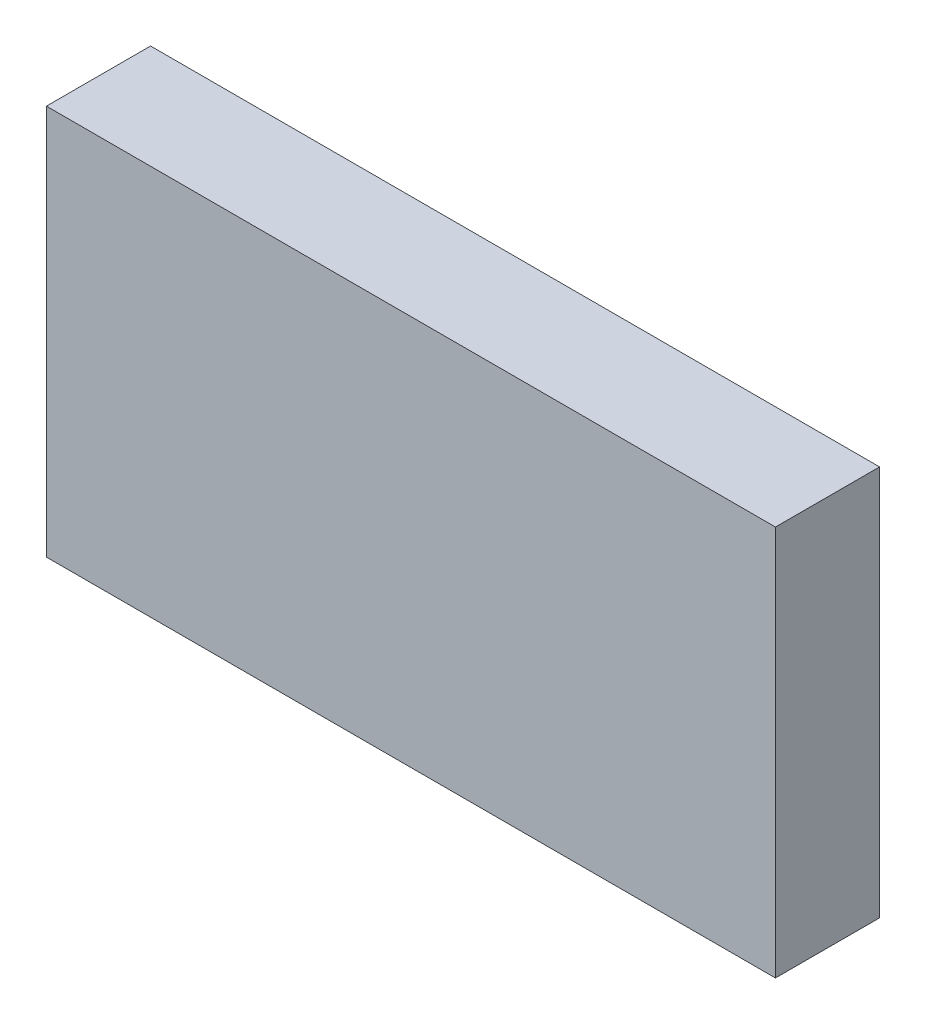
ISO-10303-21;
HEADER;
FILE_DESCRIPTION(('STEP AP214'),'2;1');
FILE_NAME('part.step','',(''),(''),'','','');
FILE_SCHEMA(('AUTOMOTIVE_DESIGN { 1 0 10303 214 1 1 1 1 }'));
ENDSEC;
DATA;
#1=APPLICATION_CONTEXT('core data for automotive mechanical design processes');
#2=APPLICATION_PROTOCOL_DEFINITION('international standard','automotive_design',2000,#1);
#3=PRODUCT_CONTEXT('',#1,'mechanical');
#4=PRODUCT('Part','Part','',(#3));
#5=PRODUCT_RELATED_PRODUCT_CATEGORY('part','',(#4));
#6=PRODUCT_DEFINITION_FORMATION('','',#4);
#7=PRODUCT_DEFINITION_CONTEXT('part definition',#1,'design');
#8=PRODUCT_DEFINITION('design','',#6,#7);
#9=PRODUCT_DEFINITION_SHAPE('','',#8);
#10=(LENGTH_UNIT() NAMED_UNIT(*) SI_UNIT(.MILLI.,.METRE.));
#11=(NAMED_UNIT(*) PLANE_ANGLE_UNIT() SI_UNIT($,.RADIAN.));
#12=(NAMED_UNIT(*) SI_UNIT($,.STERADIAN.) SOLID_ANGLE_UNIT());
#13=UNCERTAINTY_MEASURE_WITH_UNIT(LENGTH_MEASURE(1.E-05),#10,'distance_accuracy_value','');
#14=(GEOMETRIC_REPRESENTATION_CONTEXT(3) GLOBAL_UNCERTAINTY_ASSIGNED_CONTEXT((#13)) GLOBAL_UNIT_ASSIGNED_CONTEXT((#10,
#11,#12)) REPRESENTATION_CONTEXT('',''));
#15=CARTESIAN_POINT('',(0.,0.,0.));
#16=DIRECTION('',(0.,0.,1.));
#17=DIRECTION('',(1.,0.,0.));
#18=AXIS2_PLACEMENT_3D('',#15,#16,#17);
#19=CARTESIAN_POINT('',(0.78688616717888,-0.747400884353259,0.0826433070866142));
#20=DIRECTION('',(0.,0.,-1.));
#21=DIRECTION('',(0.,1.,0.));
#22=AXIS2_PLACEMENT_3D('',#19,#20,#21);
#23=PLANE('',#22);
#24=DIRECTION('',(0.,1.,0.));
#25=VECTOR('',#24,1.);
#26=CARTESIAN_POINT('',(0.790413726233998,-0.747400884353259,0.0826433070866142));
#27=LINE('',#26,#25);
#28=CARTESIAN_POINT('',(0.790413726233998,-0.70771584498318,0.0826433070866142));
#29=VERTEX_POINT('',#28);
#30=CARTESIAN_POINT('',(0.790413726233998,-0.745511120573731,0.0826433070866142));
#31=VERTEX_POINT('',#30);
#32=EDGE_CURVE('E71',#29,#31,#27,.F.);
#33=ORIENTED_EDGE('',*,*,#32,.T.);
#34=DIRECTION('',(1.,0.,0.));
#35=VECTOR('',#34,1.);
#36=CARTESIAN_POINT('',(0.864492466391478,-0.745511120573731,0.0826433070866142));
#37=LINE('',#36,#35);
#38=CARTESIAN_POINT('',(0.86096490733636,-0.745511120573731,0.0826433070866142));
#39=VERTEX_POINT('',#38);
#40=EDGE_CURVE('E54',#39,#31,#37,.F.);
#41=ORIENTED_EDGE('',*,*,#40,.F.);
#42=DIRECTION('',(0.,1.,0.));
#43=VECTOR('',#42,1.);
#44=CARTESIAN_POINT('',(0.86096490733636,-0.747400884353259,0.0826433070866142));
#45=LINE('',#44,#43);
#46=CARTESIAN_POINT('',(0.86096490733636,-0.70771584498318,0.0826433070866142));
#47=VERTEX_POINT('',#46);
#48=EDGE_CURVE('E20',#47,#39,#45,.F.);
#49=ORIENTED_EDGE('',*,*,#48,.F.);
#50=DIRECTION('',(1.,0.,0.));
#51=VECTOR('',#50,1.);
#52=CARTESIAN_POINT('',(0.864492466391478,-0.70771584498318,0.0826433070866142));
#53=LINE('',#52,#51);
#54=EDGE_CURVE('E81',#29,#47,#53,.T.);
#55=ORIENTED_EDGE('',*,*,#54,.F.);
#56=EDGE_LOOP('',(#33,#41,#49,#55));
#57=FACE_BOUND('',#56,.T.);
#58=ADVANCED_FACE('F17',(#57),#23,.F.);
#59=CARTESIAN_POINT('',(0.86096490733636,-0.747400884353259,0.0720606299212598));
#60=DIRECTION('',(-1.,0.,0.));
#61=DIRECTION('',(0.,0.,1.));
#62=AXIS2_PLACEMENT_3D('',#59,#60,#61);
#63=PLANE('',#62);
#64=DIRECTION('',(0.,0.,-1.));
#65=VECTOR('',#64,1.);
#66=CARTESIAN_POINT('',(0.86096490733636,-0.70771584498318,0.0831472440944882));
#67=LINE('',#66,#65);
#68=CARTESIAN_POINT('',(0.86096490733636,-0.70771584498318,0.0725645669291339));
#69=VERTEX_POINT('',#68);
#70=EDGE_CURVE('E64',#47,#69,#67,.T.);
#71=ORIENTED_EDGE('',*,*,#70,.F.);
#72=ORIENTED_EDGE('',*,*,#48,.T.);
#73=DIRECTION('',(0.,0.,1.));
#74=VECTOR('',#73,1.);
#75=CARTESIAN_POINT('',(0.86096490733636,-0.745511120573731,0.0720606299212598));
#76=LINE('',#75,#74);
#77=CARTESIAN_POINT('',(0.86096490733636,-0.745511120573731,0.0725645669291339));
#78=VERTEX_POINT('',#77);
#79=EDGE_CURVE('E62',#78,#39,#76,.T.);
#80=ORIENTED_EDGE('',*,*,#79,.F.);
#81=DIRECTION('',(0.,-1.,0.));
#82=VECTOR('',#81,1.);
#83=CARTESIAN_POINT('',(0.86096490733636,-0.747400884353259,0.0725645669291339));
#84=LINE('',#83,#82);
#85=EDGE_CURVE('E83',#69,#78,#84,.T.);
#86=ORIENTED_EDGE('',*,*,#85,.F.);
#87=EDGE_LOOP('',(#71,#72,#80,#86));
#88=FACE_BOUND('',#87,.T.);
#89=ADVANCED_FACE('F60',(#88),#63,.F.);
#90=CARTESIAN_POINT('',(0.864492466391478,-0.745511120573731,0.0720606299212598));
#91=DIRECTION('',(0.,1.,0.));
#92=DIRECTION('',(0.,0.,1.));
#93=AXIS2_PLACEMENT_3D('',#90,#91,#92);
#94=PLANE('',#93);
#95=DIRECTION('',(0.,0.,1.));
#96=VECTOR('',#95,1.);
#97=CARTESIAN_POINT('',(0.790413726233998,-0.745511120573731,0.0720606299212598));
#98=LINE('',#97,#96);
#99=CARTESIAN_POINT('',(0.790413726233998,-0.745511120573731,0.0725645669291339));
#100=VERTEX_POINT('',#99);
#101=EDGE_CURVE('E73',#31,#100,#98,.F.);
#102=ORIENTED_EDGE('',*,*,#101,.T.);
#103=DIRECTION('',(1.,0.,0.));
#104=VECTOR('',#103,1.);
#105=CARTESIAN_POINT('',(0.864492466391478,-0.745511120573731,0.0725645669291339));
#106=LINE('',#105,#104);
#107=EDGE_CURVE('E69',#78,#100,#106,.F.);
#108=ORIENTED_EDGE('',*,*,#107,.F.);
#109=ORIENTED_EDGE('',*,*,#79,.T.);
#110=ORIENTED_EDGE('',*,*,#40,.T.);
#111=EDGE_LOOP('',(#102,#108,#109,#110));
#112=FACE_BOUND('',#111,.T.);
#113=ADVANCED_FACE('F68',(#112),#94,.F.);
#114=CARTESIAN_POINT('',(0.790413726233998,-0.747400884353259,0.0720606299212598));
#115=DIRECTION('',(-1.,0.,0.));
#116=DIRECTION('',(0.,0.,1.));
#117=AXIS2_PLACEMENT_3D('',#114,#115,#116);
#118=PLANE('',#117);
#119=ORIENTED_EDGE('',*,*,#32,.F.);
#120=DIRECTION('',(0.,0.,-1.));
#121=VECTOR('',#120,1.);
#122=CARTESIAN_POINT('',(0.790413726233998,-0.70771584498318,0.0831472440944882));
#123=LINE('',#122,#121);
#124=CARTESIAN_POINT('',(0.790413726233998,-0.70771584498318,0.0725645669291339));
#125=VERTEX_POINT('',#124);
#126=EDGE_CURVE('E78',#125,#29,#123,.F.);
#127=ORIENTED_EDGE('',*,*,#126,.F.);
#128=DIRECTION('',(0.,-1.,0.));
#129=VECTOR('',#128,1.);
#130=CARTESIAN_POINT('',(0.790413726233998,-0.747400884353259,0.0725645669291339));
#131=LINE('',#130,#129);
#132=EDGE_CURVE('E26',#100,#125,#131,.F.);
#133=ORIENTED_EDGE('',*,*,#132,.F.);
#134=ORIENTED_EDGE('',*,*,#101,.F.);
#135=EDGE_LOOP('',(#119,#127,#133,#134));
#136=FACE_BOUND('',#135,.T.);
#137=ADVANCED_FACE('F88',(#136),#118,.T.);
#138=CARTESIAN_POINT('',(0.864492466391478,-0.70771584498318,0.0831472440944882));
#139=DIRECTION('',(0.,-1.,0.));
#140=DIRECTION('',(0.,0.,-1.));
#141=AXIS2_PLACEMENT_3D('',#138,#139,#140);
#142=PLANE('',#141);
#143=ORIENTED_EDGE('',*,*,#126,.T.);
#144=ORIENTED_EDGE('',*,*,#54,.T.);
#145=ORIENTED_EDGE('',*,*,#70,.T.);
#146=DIRECTION('',(1.,0.,0.));
#147=VECTOR('',#146,1.);
#148=CARTESIAN_POINT('',(0.864492466391478,-0.70771584498318,0.0725645669291339));
#149=LINE('',#148,#147);
#150=EDGE_CURVE('E11',#125,#69,#149,.T.);
#151=ORIENTED_EDGE('',*,*,#150,.F.);
#152=EDGE_LOOP('',(#143,#144,#145,#151));
#153=FACE_BOUND('',#152,.T.);
#154=ADVANCED_FACE('F91',(#153),#142,.F.);
#155=CARTESIAN_POINT('',(0.864492466391478,-0.747400884353259,0.0725645669291339));
#156=DIRECTION('',(0.,0.,1.));
#157=DIRECTION('',(0.,-1.,0.));
#158=AXIS2_PLACEMENT_3D('',#155,#156,#157);
#159=PLANE('',#158);
#160=ORIENTED_EDGE('',*,*,#132,.T.);
#161=ORIENTED_EDGE('',*,*,#150,.T.);
#162=ORIENTED_EDGE('',*,*,#85,.T.);
#163=ORIENTED_EDGE('',*,*,#107,.T.);
#164=EDGE_LOOP('',(#160,#161,#162,#163));
#165=FACE_BOUND('',#164,.T.);
#166=ADVANCED_FACE('F86',(#165),#159,.F.);
#167=CLOSED_SHELL('',(#58,#89,#113,#137,#154,#166));
#168=MANIFOLD_SOLID_BREP('B1',#167);
#169=ADVANCED_BREP_SHAPE_REPRESENTATION('',(#18,#168),#14);
#170=SHAPE_DEFINITION_REPRESENTATION(#9,#169);
ENDSEC;
END-ISO-10303-21;
